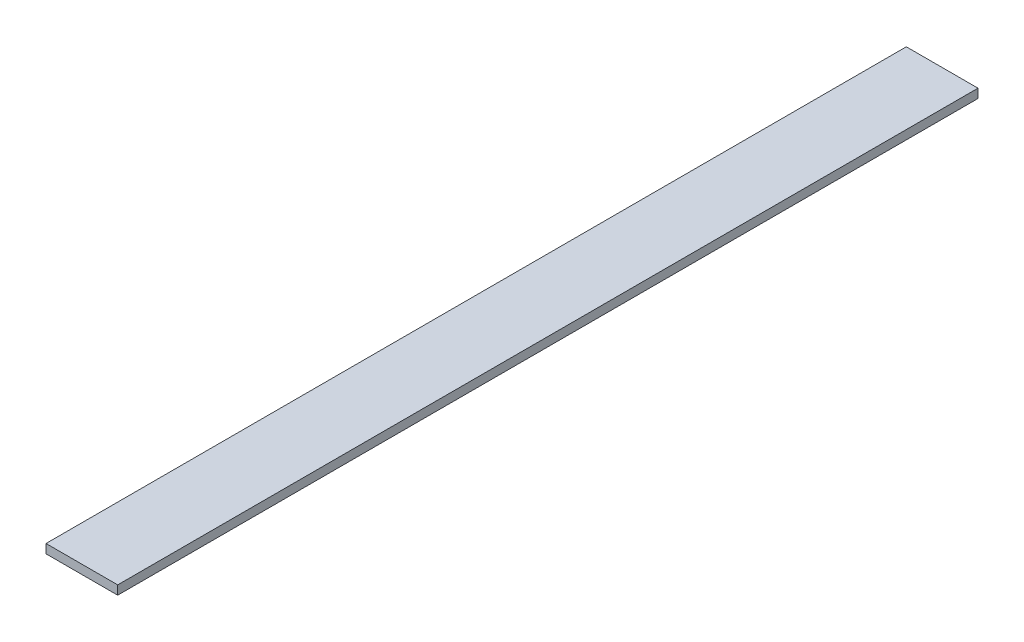
ISO-10303-21;
HEADER;
FILE_DESCRIPTION(('STEP AP214'),'2;1');
FILE_NAME('part.step','',(''),(''),'','','');
FILE_SCHEMA(('AUTOMOTIVE_DESIGN { 1 0 10303 214 1 1 1 1 }'));
ENDSEC;
DATA;
#1=APPLICATION_CONTEXT('core data for automotive mechanical design processes');
#2=APPLICATION_PROTOCOL_DEFINITION('international standard','automotive_design',2000,#1);
#3=PRODUCT_CONTEXT('',#1,'mechanical');
#4=PRODUCT('Part','Part','',(#3));
#5=PRODUCT_RELATED_PRODUCT_CATEGORY('part','',(#4));
#6=PRODUCT_DEFINITION_FORMATION('','',#4);
#7=PRODUCT_DEFINITION_CONTEXT('part definition',#1,'design');
#8=PRODUCT_DEFINITION('design','',#6,#7);
#9=PRODUCT_DEFINITION_SHAPE('','',#8);
#10=(LENGTH_UNIT() NAMED_UNIT(*) SI_UNIT(.MILLI.,.METRE.));
#11=(NAMED_UNIT(*) PLANE_ANGLE_UNIT() SI_UNIT($,.RADIAN.));
#12=(NAMED_UNIT(*) SI_UNIT($,.STERADIAN.) SOLID_ANGLE_UNIT());
#13=UNCERTAINTY_MEASURE_WITH_UNIT(LENGTH_MEASURE(1.E-05),#10,'distance_accuracy_value','');
#14=(GEOMETRIC_REPRESENTATION_CONTEXT(3) GLOBAL_UNCERTAINTY_ASSIGNED_CONTEXT((#13)) GLOBAL_UNIT_ASSIGNED_CONTEXT((#10,
#11,#12)) REPRESENTATION_CONTEXT('',''));
#15=CARTESIAN_POINT('',(0.,0.,0.));
#16=DIRECTION('',(0.,0.,1.));
#17=DIRECTION('',(1.,0.,0.));
#18=AXIS2_PLACEMENT_3D('',#15,#16,#17);
#19=CARTESIAN_POINT('',(0.,1.5875,0.));
#20=DIRECTION('',(1.,0.,0.));
#21=DIRECTION('',(0.,0.,-1.));
#22=AXIS2_PLACEMENT_3D('',#19,#20,#21);
#23=PLANE('',#22);
#24=DIRECTION('',(0.,0.,1.));
#25=VECTOR('',#24,1.);
#26=CARTESIAN_POINT('',(0.,0.,0.));
#27=LINE('',#26,#25);
#28=CARTESIAN_POINT('',(0.,0.,-152.4));
#29=VERTEX_POINT('',#28);
#30=CARTESIAN_POINT('',(0.,0.,0.));
#31=VERTEX_POINT('',#30);
#32=EDGE_CURVE('E98',#29,#31,#27,.T.);
#33=ORIENTED_EDGE('',*,*,#32,.T.);
#34=DIRECTION('',(0.,-1.,0.));
#35=VECTOR('',#34,1.);
#36=CARTESIAN_POINT('',(0.,1.5875,0.));
#37=LINE('',#36,#35);
#38=CARTESIAN_POINT('',(0.,1.5875,0.));
#39=VERTEX_POINT('',#38);
#40=EDGE_CURVE('E11',#39,#31,#37,.T.);
#41=ORIENTED_EDGE('',*,*,#40,.F.);
#42=DIRECTION('',(0.,0.,1.));
#43=VECTOR('',#42,1.);
#44=CARTESIAN_POINT('',(0.,1.5875,0.));
#45=LINE('',#44,#43);
#46=CARTESIAN_POINT('',(0.,1.5875,-152.4));
#47=VERTEX_POINT('',#46);
#48=EDGE_CURVE('E86',#47,#39,#45,.T.);
#49=ORIENTED_EDGE('',*,*,#48,.F.);
#50=DIRECTION('',(0.,-1.,0.));
#51=VECTOR('',#50,1.);
#52=CARTESIAN_POINT('',(0.,1.5875,-152.4));
#53=LINE('',#52,#51);
#54=EDGE_CURVE('E94',#47,#29,#53,.T.);
#55=ORIENTED_EDGE('',*,*,#54,.T.);
#56=EDGE_LOOP('',(#33,#41,#49,#55));
#57=FACE_BOUND('',#56,.T.);
#58=ADVANCED_FACE('F35',(#57),#23,.F.);
#59=CARTESIAN_POINT('',(0.,1.5875,0.));
#60=DIRECTION('',(0.,0.,-1.));
#61=DIRECTION('',(-1.,0.,0.));
#62=AXIS2_PLACEMENT_3D('',#59,#60,#61);
#63=PLANE('',#62);
#64=DIRECTION('',(1.,0.,0.));
#65=VECTOR('',#64,1.);
#66=CARTESIAN_POINT('',(0.,0.,0.));
#67=LINE('',#66,#65);
#68=CARTESIAN_POINT('',(12.7,0.,0.));
#69=VERTEX_POINT('',#68);
#70=EDGE_CURVE('E90',#31,#69,#67,.T.);
#71=ORIENTED_EDGE('',*,*,#70,.T.);
#72=DIRECTION('',(0.,-1.,0.));
#73=VECTOR('',#72,1.);
#74=CARTESIAN_POINT('',(12.7,1.5875,0.));
#75=LINE('',#74,#73);
#76=CARTESIAN_POINT('',(12.7,1.5875,0.));
#77=VERTEX_POINT('',#76);
#78=EDGE_CURVE('E43',#77,#69,#75,.T.);
#79=ORIENTED_EDGE('',*,*,#78,.F.);
#80=DIRECTION('',(1.,0.,0.));
#81=VECTOR('',#80,1.);
#82=CARTESIAN_POINT('',(0.,1.5875,0.));
#83=LINE('',#82,#81);
#84=EDGE_CURVE('E81',#39,#77,#83,.T.);
#85=ORIENTED_EDGE('',*,*,#84,.F.);
#86=ORIENTED_EDGE('',*,*,#40,.T.);
#87=EDGE_LOOP('',(#71,#79,#85,#86));
#88=FACE_BOUND('',#87,.T.);
#89=ADVANCED_FACE('F89',(#88),#63,.F.);
#90=CARTESIAN_POINT('',(12.7,1.5875,0.));
#91=DIRECTION('',(-1.,0.,0.));
#92=DIRECTION('',(0.,0.,1.));
#93=AXIS2_PLACEMENT_3D('',#90,#91,#92);
#94=PLANE('',#93);
#95=DIRECTION('',(0.,0.,-1.));
#96=VECTOR('',#95,1.);
#97=CARTESIAN_POINT('',(12.7,0.,0.));
#98=LINE('',#97,#96);
#99=CARTESIAN_POINT('',(12.7,0.,-152.4));
#100=VERTEX_POINT('',#99);
#101=EDGE_CURVE('E68',#69,#100,#98,.T.);
#102=ORIENTED_EDGE('',*,*,#101,.T.);
#103=DIRECTION('',(0.,-1.,0.));
#104=VECTOR('',#103,1.);
#105=CARTESIAN_POINT('',(12.7,1.5875,-152.4));
#106=LINE('',#105,#104);
#107=CARTESIAN_POINT('',(12.7,1.5875,-152.4));
#108=VERTEX_POINT('',#107);
#109=EDGE_CURVE('E91',#108,#100,#106,.T.);
#110=ORIENTED_EDGE('',*,*,#109,.F.);
#111=DIRECTION('',(0.,0.,-1.));
#112=VECTOR('',#111,1.);
#113=CARTESIAN_POINT('',(12.7,1.5875,0.));
#114=LINE('',#113,#112);
#115=EDGE_CURVE('E84',#77,#108,#114,.T.);
#116=ORIENTED_EDGE('',*,*,#115,.F.);
#117=ORIENTED_EDGE('',*,*,#78,.T.);
#118=EDGE_LOOP('',(#102,#110,#116,#117));
#119=FACE_BOUND('',#118,.T.);
#120=ADVANCED_FACE('F92',(#119),#94,.F.);
#121=CARTESIAN_POINT('',(0.,1.5875,-152.4));
#122=DIRECTION('',(0.,0.,1.));
#123=DIRECTION('',(1.,0.,0.));
#124=AXIS2_PLACEMENT_3D('',#121,#122,#123);
#125=PLANE('',#124);
#126=DIRECTION('',(-1.,0.,0.));
#127=VECTOR('',#126,1.);
#128=CARTESIAN_POINT('',(0.,0.,-152.4));
#129=LINE('',#128,#127);
#130=EDGE_CURVE('E74',#100,#29,#129,.T.);
#131=ORIENTED_EDGE('',*,*,#130,.T.);
#132=ORIENTED_EDGE('',*,*,#54,.F.);
#133=DIRECTION('',(-1.,0.,0.));
#134=VECTOR('',#133,1.);
#135=CARTESIAN_POINT('',(0.,1.5875,-152.4));
#136=LINE('',#135,#134);
#137=EDGE_CURVE('E51',#108,#47,#136,.T.);
#138=ORIENTED_EDGE('',*,*,#137,.F.);
#139=ORIENTED_EDGE('',*,*,#109,.T.);
#140=EDGE_LOOP('',(#131,#132,#138,#139));
#141=FACE_BOUND('',#140,.T.);
#142=ADVANCED_FACE('F105',(#141),#125,.F.);
#143=CARTESIAN_POINT('',(0.,1.5875,0.));
#144=DIRECTION('',(0.,-1.,0.));
#145=DIRECTION('',(0.,0.,-1.));
#146=AXIS2_PLACEMENT_3D('',#143,#144,#145);
#147=PLANE('',#146);
#148=ORIENTED_EDGE('',*,*,#48,.T.);
#149=ORIENTED_EDGE('',*,*,#84,.T.);
#150=ORIENTED_EDGE('',*,*,#115,.T.);
#151=ORIENTED_EDGE('',*,*,#137,.T.);
#152=EDGE_LOOP('',(#148,#149,#150,#151));
#153=FACE_BOUND('',#152,.T.);
#154=ADVANCED_FACE('F82',(#153),#147,.F.);
#155=CARTESIAN_POINT('',(0.,0.,0.));
#156=DIRECTION('',(0.,-1.,0.));
#157=DIRECTION('',(0.,0.,-1.));
#158=AXIS2_PLACEMENT_3D('',#155,#156,#157);
#159=PLANE('',#158);
#160=ORIENTED_EDGE('',*,*,#32,.F.);
#161=ORIENTED_EDGE('',*,*,#130,.F.);
#162=ORIENTED_EDGE('',*,*,#101,.F.);
#163=ORIENTED_EDGE('',*,*,#70,.F.);
#164=EDGE_LOOP('',(#160,#161,#162,#163));
#165=FACE_BOUND('',#164,.T.);
#166=ADVANCED_FACE('F108',(#165),#159,.T.);
#167=CLOSED_SHELL('',(#58,#89,#120,#142,#154,#166));
#168=MANIFOLD_SOLID_BREP('B2',#167);
#169=ADVANCED_BREP_SHAPE_REPRESENTATION('',(#18,#168),#14);
#170=SHAPE_DEFINITION_REPRESENTATION(#9,#169);
ENDSEC;
END-ISO-10303-21;
